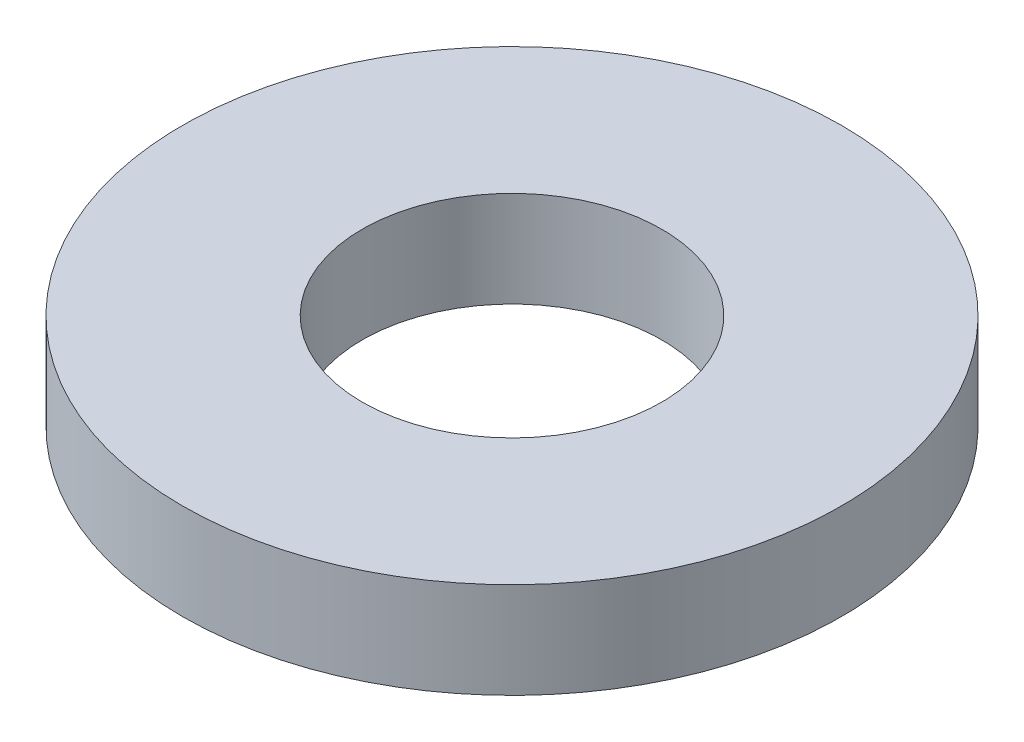
ISO-10303-21;
HEADER;
FILE_DESCRIPTION(('STEP AP214'),'2;1');
FILE_NAME('part.step','',(''),(''),'','','');
FILE_SCHEMA(('AUTOMOTIVE_DESIGN { 1 0 10303 214 1 1 1 1 }'));
ENDSEC;
DATA;
#1=APPLICATION_CONTEXT('core data for automotive mechanical design processes');
#2=APPLICATION_PROTOCOL_DEFINITION('international standard','automotive_design',2000,#1);
#3=PRODUCT_CONTEXT('',#1,'mechanical');
#4=PRODUCT('Part','Part','',(#3));
#5=PRODUCT_RELATED_PRODUCT_CATEGORY('part','',(#4));
#6=PRODUCT_DEFINITION_FORMATION('','',#4);
#7=PRODUCT_DEFINITION_CONTEXT('part definition',#1,'design');
#8=PRODUCT_DEFINITION('design','',#6,#7);
#9=PRODUCT_DEFINITION_SHAPE('','',#8);
#10=(LENGTH_UNIT() NAMED_UNIT(*) SI_UNIT(.MILLI.,.METRE.));
#11=(NAMED_UNIT(*) PLANE_ANGLE_UNIT() SI_UNIT($,.RADIAN.));
#12=(NAMED_UNIT(*) SI_UNIT($,.STERADIAN.) SOLID_ANGLE_UNIT());
#13=UNCERTAINTY_MEASURE_WITH_UNIT(LENGTH_MEASURE(1.E-05),#10,'distance_accuracy_value','');
#14=(GEOMETRIC_REPRESENTATION_CONTEXT(3) GLOBAL_UNCERTAINTY_ASSIGNED_CONTEXT((#13)) GLOBAL_UNIT_ASSIGNED_CONTEXT((#10,
#11,#12)) REPRESENTATION_CONTEXT('',''));
#15=CARTESIAN_POINT('',(0.,0.,0.));
#16=DIRECTION('',(0.,0.,1.));
#17=DIRECTION('',(1.,0.,0.));
#18=AXIS2_PLACEMENT_3D('',#15,#16,#17);
#19=CARTESIAN_POINT('',(0.,16.,0.));
#20=DIRECTION('',(0.,-1.,0.));
#21=DIRECTION('',(0.,0.,-1.));
#22=AXIS2_PLACEMENT_3D('',#19,#20,#21);
#23=CYLINDRICAL_SURFACE('',#22,55.);
#24=CARTESIAN_POINT('',(0.,16.,0.));
#25=DIRECTION('',(0.,1.,0.));
#26=DIRECTION('',(0.,0.,1.));
#27=AXIS2_PLACEMENT_3D('',#24,#25,#26);
#28=CIRCLE('',#27,55.);
#29=CARTESIAN_POINT('',(0.,16.,55.));
#30=VERTEX_POINT('',#29);
#31=EDGE_CURVE('E10',#30,#30,#28,.T.);
#32=ORIENTED_EDGE('',*,*,#31,.F.);
#33=EDGE_LOOP('',(#32));
#34=FACE_BOUND('',#33,.T.);
#35=CARTESIAN_POINT('',(0.,0.,0.));
#36=DIRECTION('',(0.,1.,0.));
#37=DIRECTION('',(0.,0.,1.));
#38=AXIS2_PLACEMENT_3D('',#35,#36,#37);
#39=CIRCLE('',#38,55.);
#40=CARTESIAN_POINT('',(0.,0.,55.));
#41=VERTEX_POINT('',#40);
#42=EDGE_CURVE('E37',#41,#41,#39,.T.);
#43=ORIENTED_EDGE('',*,*,#42,.T.);
#44=EDGE_LOOP('',(#43));
#45=FACE_BOUND('',#44,.T.);
#46=ADVANCED_FACE('F40',(#34,#45),#23,.T.);
#47=CARTESIAN_POINT('',(0.,16.,0.));
#48=DIRECTION('',(0.,1.,0.));
#49=DIRECTION('',(0.,0.,1.));
#50=AXIS2_PLACEMENT_3D('',#47,#48,#49);
#51=PLANE('',#50);
#52=CARTESIAN_POINT('',(0.,16.,0.));
#53=DIRECTION('',(0.,1.,0.));
#54=DIRECTION('',(0.,0.,1.));
#55=AXIS2_PLACEMENT_3D('',#52,#53,#54);
#56=CIRCLE('',#55,25.);
#57=CARTESIAN_POINT('',(0.,16.,25.));
#58=VERTEX_POINT('',#57);
#59=EDGE_CURVE('E50',#58,#58,#56,.T.);
#60=ORIENTED_EDGE('',*,*,#59,.F.);
#61=EDGE_LOOP('',(#60));
#62=FACE_BOUND('',#61,.T.);
#63=ORIENTED_EDGE('',*,*,#31,.T.);
#64=EDGE_LOOP('',(#63));
#65=FACE_BOUND('',#64,.T.);
#66=ADVANCED_FACE('F59',(#62,#65),#51,.T.);
#67=CARTESIAN_POINT('',(0.,0.,0.));
#68=DIRECTION('',(0.,1.,0.));
#69=DIRECTION('',(0.,0.,1.));
#70=AXIS2_PLACEMENT_3D('',#67,#68,#69);
#71=PLANE('',#70);
#72=CARTESIAN_POINT('',(0.,0.,0.));
#73=DIRECTION('',(0.,1.,0.));
#74=DIRECTION('',(0.,0.,1.));
#75=AXIS2_PLACEMENT_3D('',#72,#73,#74);
#76=CIRCLE('',#75,25.);
#77=CARTESIAN_POINT('',(0.,0.,25.));
#78=VERTEX_POINT('',#77);
#79=EDGE_CURVE('E47',#78,#78,#76,.T.);
#80=ORIENTED_EDGE('',*,*,#79,.T.);
#81=EDGE_LOOP('',(#80));
#82=FACE_BOUND('',#81,.T.);
#83=ORIENTED_EDGE('',*,*,#42,.F.);
#84=EDGE_LOOP('',(#83));
#85=FACE_BOUND('',#84,.T.);
#86=ADVANCED_FACE('F58',(#82,#85),#71,.F.);
#87=CARTESIAN_POINT('',(0.,16.,0.));
#88=DIRECTION('',(0.,-1.,0.));
#89=DIRECTION('',(0.,0.,-1.));
#90=AXIS2_PLACEMENT_3D('',#87,#88,#89);
#91=CYLINDRICAL_SURFACE('',#90,25.);
#92=ORIENTED_EDGE('',*,*,#59,.T.);
#93=EDGE_LOOP('',(#92));
#94=FACE_BOUND('',#93,.T.);
#95=ORIENTED_EDGE('',*,*,#79,.F.);
#96=EDGE_LOOP('',(#95));
#97=FACE_BOUND('',#96,.T.);
#98=ADVANCED_FACE('F54',(#94,#97),#91,.F.);
#99=CLOSED_SHELL('',(#46,#66,#86,#98));
#100=MANIFOLD_SOLID_BREP('B2',#99);
#101=ADVANCED_BREP_SHAPE_REPRESENTATION('',(#18,#100),#14);
#102=SHAPE_DEFINITION_REPRESENTATION(#9,#101);
ENDSEC;
END-ISO-10303-21;
